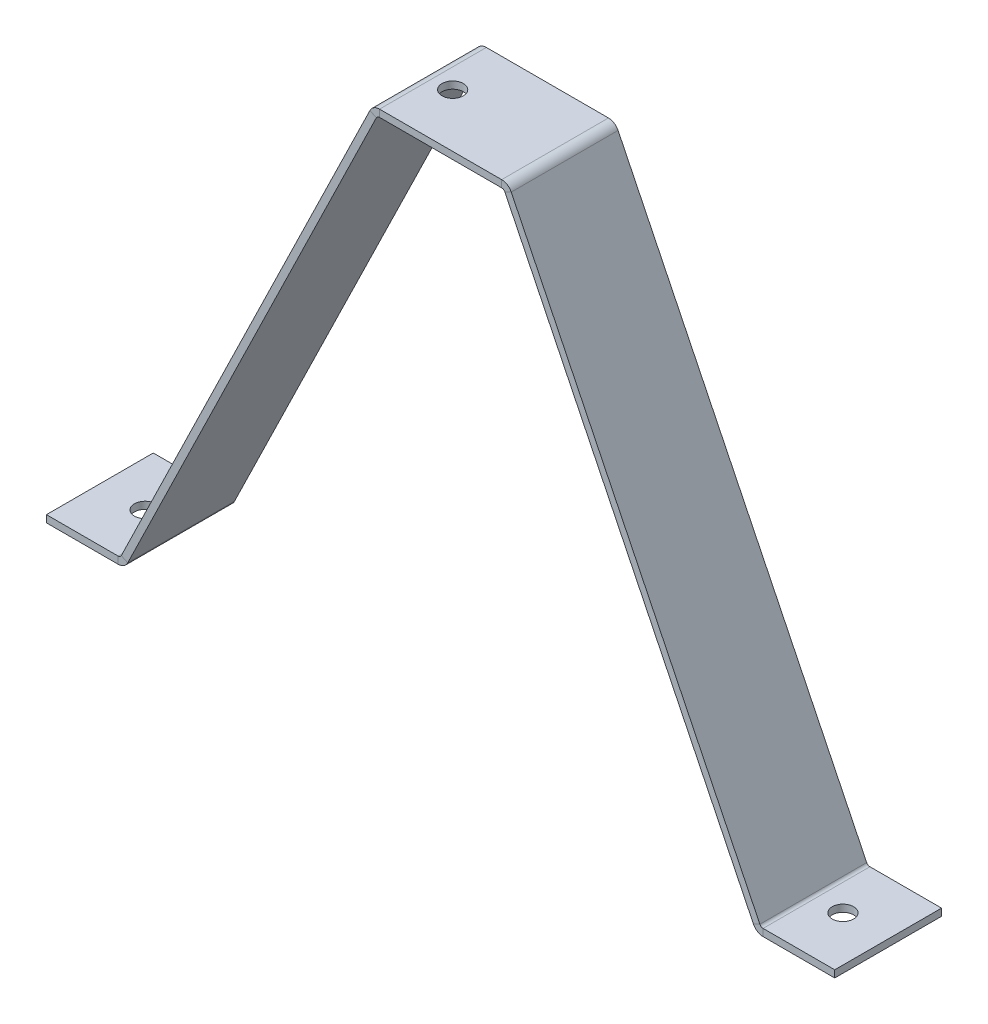
ISO-10303-21;
HEADER;
FILE_DESCRIPTION(('STEP AP214'),'2;1');
FILE_NAME('part.step','',(''),(''),'','','');
FILE_SCHEMA(('AUTOMOTIVE_DESIGN { 1 0 10303 214 1 1 1 1 }'));
ENDSEC;
DATA;
#1=APPLICATION_CONTEXT('core data for automotive mechanical design processes');
#2=APPLICATION_PROTOCOL_DEFINITION('international standard','automotive_design',2000,#1);
#3=PRODUCT_CONTEXT('',#1,'mechanical');
#4=PRODUCT('Part','Part','',(#3));
#5=PRODUCT_RELATED_PRODUCT_CATEGORY('part','',(#4));
#6=PRODUCT_DEFINITION_FORMATION('','',#4);
#7=PRODUCT_DEFINITION_CONTEXT('part definition',#1,'design');
#8=PRODUCT_DEFINITION('design','',#6,#7);
#9=PRODUCT_DEFINITION_SHAPE('','',#8);
#10=(LENGTH_UNIT() NAMED_UNIT(*) SI_UNIT(.MILLI.,.METRE.));
#11=(NAMED_UNIT(*) PLANE_ANGLE_UNIT() SI_UNIT($,.RADIAN.));
#12=(NAMED_UNIT(*) SI_UNIT($,.STERADIAN.) SOLID_ANGLE_UNIT());
#13=UNCERTAINTY_MEASURE_WITH_UNIT(LENGTH_MEASURE(1.E-05),#10,'distance_accuracy_value','');
#14=(GEOMETRIC_REPRESENTATION_CONTEXT(3) GLOBAL_UNCERTAINTY_ASSIGNED_CONTEXT((#13)) GLOBAL_UNIT_ASSIGNED_CONTEXT((#10,
#11,#12)) REPRESENTATION_CONTEXT('',''));
#15=CARTESIAN_POINT('',(0.,0.,0.));
#16=DIRECTION('',(0.,0.,1.));
#17=DIRECTION('',(1.,0.,0.));
#18=AXIS2_PLACEMENT_3D('',#15,#16,#17);
#19=CARTESIAN_POINT('',(9.78619210582397,0.438371146789082,-7.5));
#20=DIRECTION('',(0.,0.,-1.));
#21=DIRECTION('',(-1.,0.,0.));
#22=AXIS2_PLACEMENT_3D('',#19,#20,#21);
#23=PLANE('',#22);
#24=DIRECTION('',(-0.438371146789082,0.898794046299165,0.));
#25=VECTOR('',#24,1.);
#26=CARTESIAN_POINT('',(9.78619210582398,0.438371146789083,-7.5));
#27=LINE('',#26,#25);
#28=CARTESIAN_POINT('',(9.9231544530189,0.157556720183625,-7.5));
#29=VERTEX_POINT('',#28);
#30=CARTESIAN_POINT('',(44.8340065123781,-71.4202973699261,-7.50000000000001));
#31=VERTEX_POINT('',#30);
#32=EDGE_CURVE('E376',#29,#31,#27,.F.);
#33=ORIENTED_EDGE('',*,*,#32,.T.);
#34=DIRECTION('',(-0.898794046299163,-0.438371146789085,0.));
#35=VECTOR('',#34,1.);
#36=CARTESIAN_POINT('',(44.8340065123781,-71.4202973699261,-7.50000000000001));
#37=LINE('',#36,#35);
#38=CARTESIAN_POINT('',(43.9352124660789,-71.8586685167152,-7.50000000000001));
#39=VERTEX_POINT('',#38);
#40=EDGE_CURVE('E307',#31,#39,#37,.T.);
#41=ORIENTED_EDGE('',*,*,#40,.T.);
#42=DIRECTION('',(0.438371146789082,-0.898794046299165,0.));
#43=VECTOR('',#42,1.);
#44=CARTESIAN_POINT('',(6.96570543615307,3.94005376803364,-7.5));
#45=LINE('',#44,#43);
#46=CARTESIAN_POINT('',(9.02436040671973,-0.280814426605457,-7.5));
#47=VERTEX_POINT('',#46);
#48=EDGE_CURVE('E381',#47,#39,#45,.T.);
#49=ORIENTED_EDGE('',*,*,#48,.F.);
#50=DIRECTION('',(0.898794046299165,0.438371146789082,0.));
#51=VECTOR('',#50,1.);
#52=CARTESIAN_POINT('',(9.92315445301889,0.157556720183623,-7.5));
#53=LINE('',#52,#51);
#54=EDGE_CURVE('E371',#47,#29,#53,.T.);
#55=ORIENTED_EDGE('',*,*,#54,.T.);
#56=EDGE_LOOP('',(#33,#41,#49,#55));
#57=FACE_BOUND('',#56,.T.);
#58=ADVANCED_FACE('F119',(#57),#23,.T.);
#59=CARTESIAN_POINT('',(7.86449948245223,4.37842491482272,0.));
#60=DIRECTION('',(-0.898794046299165,-0.438371146789082,0.));
#61=DIRECTION('',(0.438371146789082,-0.898794046299165,0.));
#62=AXIS2_PLACEMENT_3D('',#59,#60,#61);
#63=PLANE('',#62);
#64=DIRECTION('',(0.,0.,-1.));
#65=VECTOR('',#64,1.);
#66=CARTESIAN_POINT('',(44.8340065123781,-71.4202973699261,-7.50000000000001));
#67=LINE('',#66,#65);
#68=CARTESIAN_POINT('',(44.8340065123781,-71.4202973699261,7.49999999999999));
#69=VERTEX_POINT('',#68);
#70=EDGE_CURVE('E313',#31,#69,#67,.F.);
#71=ORIENTED_EDGE('',*,*,#70,.F.);
#72=ORIENTED_EDGE('',*,*,#32,.F.);
#73=DIRECTION('',(0.,0.,1.));
#74=VECTOR('',#73,1.);
#75=CARTESIAN_POINT('',(9.9231544530189,0.157556720183625,-7.50000000000001));
#76=LINE('',#75,#74);
#77=CARTESIAN_POINT('',(9.9231544530189,0.157556720183617,7.5));
#78=VERTEX_POINT('',#77);
#79=EDGE_CURVE('E384',#78,#29,#76,.F.);
#80=ORIENTED_EDGE('',*,*,#79,.F.);
#81=DIRECTION('',(0.438371146789082,-0.898794046299165,0.));
#82=VECTOR('',#81,1.);
#83=CARTESIAN_POINT('',(45.4587014481388,-72.7011117965315,7.49999999999999));
#84=LINE('',#83,#82);
#85=EDGE_CURVE('E373',#69,#78,#84,.F.);
#86=ORIENTED_EDGE('',*,*,#85,.F.);
#87=EDGE_LOOP('',(#71,#72,#80,#86));
#88=FACE_BOUND('',#87,.T.);
#89=ADVANCED_FACE('F533',(#88),#63,.F.);
#90=CARTESIAN_POINT('',(6.96570543615307,3.94005376803364,0.));
#91=DIRECTION('',(-0.898794046299165,-0.438371146789082,0.));
#92=DIRECTION('',(0.438371146789082,-0.898794046299165,0.));
#93=AXIS2_PLACEMENT_3D('',#90,#91,#92);
#94=PLANE('',#93);
#95=ORIENTED_EDGE('',*,*,#48,.T.);
#96=DIRECTION('',(0.,0.,-1.));
#97=VECTOR('',#96,1.);
#98=CARTESIAN_POINT('',(43.9352124660789,-71.8586685167152,-7.50000000000001));
#99=LINE('',#98,#97);
#100=CARTESIAN_POINT('',(43.9352124660789,-71.8586685167152,7.49999999999999));
#101=VERTEX_POINT('',#100);
#102=EDGE_CURVE('E302',#39,#101,#99,.F.);
#103=ORIENTED_EDGE('',*,*,#102,.T.);
#104=DIRECTION('',(-0.438371146789082,0.898794046299165,0.));
#105=VECTOR('',#104,1.);
#106=CARTESIAN_POINT('',(6.96570543615307,3.94005376803364,7.5));
#107=LINE('',#106,#105);
#108=CARTESIAN_POINT('',(9.02436040671973,-0.280814426605465,7.5));
#109=VERTEX_POINT('',#108);
#110=EDGE_CURVE('E379',#101,#109,#107,.T.);
#111=ORIENTED_EDGE('',*,*,#110,.T.);
#112=DIRECTION('',(0.,0.,1.));
#113=VECTOR('',#112,1.);
#114=CARTESIAN_POINT('',(9.02436040671973,-0.280814426605456,-7.50000000000001));
#115=LINE('',#114,#113);
#116=EDGE_CURVE('E389',#47,#109,#115,.T.);
#117=ORIENTED_EDGE('',*,*,#116,.F.);
#118=EDGE_LOOP('',(#95,#103,#111,#117));
#119=FACE_BOUND('',#118,.T.);
#120=ADVANCED_FACE('F539',(#119),#94,.T.);
#121=CARTESIAN_POINT('',(-45.4587014481388,-72.7011117965315,7.5));
#122=DIRECTION('',(0.,0.,1.));
#123=DIRECTION('',(1.,0.,0.));
#124=AXIS2_PLACEMENT_3D('',#121,#122,#123);
#125=PLANE('',#124);
#126=DIRECTION('',(-0.438371146789081,-0.898794046299165,0.));
#127=VECTOR('',#126,1.);
#128=CARTESIAN_POINT('',(-45.4587014481388,-72.7011117965315,7.5));
#129=LINE('',#128,#127);
#130=CARTESIAN_POINT('',(-9.92315445301889,0.157556720183624,7.5));
#131=VERTEX_POINT('',#130);
#132=CARTESIAN_POINT('',(-44.834006512378,-71.4202973699261,7.5));
#133=VERTEX_POINT('',#132);
#134=EDGE_CURVE('E420',#131,#133,#129,.T.);
#135=ORIENTED_EDGE('',*,*,#134,.T.);
#136=DIRECTION('',(0.89879404629916,-0.438371146789091,0.));
#137=VECTOR('',#136,1.);
#138=CARTESIAN_POINT('',(-44.8340065123781,-71.4202973699261,7.50000000000001));
#139=LINE('',#138,#137);
#140=CARTESIAN_POINT('',(-43.9352124660789,-71.8586685167152,7.50000000000001));
#141=VERTEX_POINT('',#140);
#142=EDGE_CURVE('E359',#133,#141,#139,.T.);
#143=ORIENTED_EDGE('',*,*,#142,.T.);
#144=DIRECTION('',(0.438371146789081,0.898794046299165,0.));
#145=VECTOR('',#144,1.);
#146=CARTESIAN_POINT('',(-6.96570543615306,3.94005376803364,7.5));
#147=LINE('',#146,#145);
#148=CARTESIAN_POINT('',(-9.02436040671973,-0.280814426605458,7.5));
#149=VERTEX_POINT('',#148);
#150=EDGE_CURVE('E425',#149,#141,#147,.F.);
#151=ORIENTED_EDGE('',*,*,#150,.F.);
#152=DIRECTION('',(-0.898794046299165,0.438371146789081,0.));
#153=VECTOR('',#152,1.);
#154=CARTESIAN_POINT('',(-9.92315445301891,0.157556720183624,7.5));
#155=LINE('',#154,#153);
#156=EDGE_CURVE('E414',#149,#131,#155,.T.);
#157=ORIENTED_EDGE('',*,*,#156,.T.);
#158=EDGE_LOOP('',(#135,#143,#151,#157));
#159=FACE_BOUND('',#158,.T.);
#160=ADVANCED_FACE('F487',(#159),#125,.T.);
#161=CARTESIAN_POINT('',(-7.86449948245223,4.37842491482272,0.));
#162=DIRECTION('',(-0.898794046299165,0.438371146789081,0.));
#163=DIRECTION('',(-0.438371146789081,-0.898794046299165,0.));
#164=AXIS2_PLACEMENT_3D('',#161,#162,#163);
#165=PLANE('',#164);
#166=DIRECTION('',(0.438371146789081,0.898794046299165,0.));
#167=VECTOR('',#166,1.);
#168=CARTESIAN_POINT('',(-9.78619210582397,0.438371146789081,-7.5));
#169=LINE('',#168,#167);
#170=CARTESIAN_POINT('',(-44.834006512378,-71.4202973699261,-7.5));
#171=VERTEX_POINT('',#170);
#172=CARTESIAN_POINT('',(-9.92315445301889,0.157556720183624,-7.5));
#173=VERTEX_POINT('',#172);
#174=EDGE_CURVE('E417',#171,#173,#169,.T.);
#175=ORIENTED_EDGE('',*,*,#174,.F.);
#176=DIRECTION('',(0.,0.,1.));
#177=VECTOR('',#176,1.);
#178=CARTESIAN_POINT('',(-44.8340065123781,-71.4202973699261,7.50000000000001));
#179=LINE('',#178,#177);
#180=EDGE_CURVE('E365',#133,#171,#179,.F.);
#181=ORIENTED_EDGE('',*,*,#180,.F.);
#182=ORIENTED_EDGE('',*,*,#134,.F.);
#183=DIRECTION('',(0.,0.,-1.));
#184=VECTOR('',#183,1.);
#185=CARTESIAN_POINT('',(-9.92315445301889,0.157556720183624,0.));
#186=LINE('',#185,#184);
#187=EDGE_CURVE('E428',#131,#173,#186,.T.);
#188=ORIENTED_EDGE('',*,*,#187,.T.);
#189=EDGE_LOOP('',(#175,#181,#182,#188));
#190=FACE_BOUND('',#189,.T.);
#191=ADVANCED_FACE('F490',(#190),#165,.T.);
#192=CARTESIAN_POINT('',(-6.96570543615307,3.94005376803364,0.));
#193=DIRECTION('',(-0.898794046299165,0.438371146789081,0.));
#194=DIRECTION('',(-0.438371146789081,-0.898794046299165,0.));
#195=AXIS2_PLACEMENT_3D('',#192,#193,#194);
#196=PLANE('',#195);
#197=DIRECTION('',(0.,0.,1.));
#198=VECTOR('',#197,1.);
#199=CARTESIAN_POINT('',(-43.9352124660789,-71.8586685167152,7.50000000000001));
#200=LINE('',#199,#198);
#201=CARTESIAN_POINT('',(-43.9352124660789,-71.8586685167152,-7.5));
#202=VERTEX_POINT('',#201);
#203=EDGE_CURVE('E353',#141,#202,#200,.F.);
#204=ORIENTED_EDGE('',*,*,#203,.T.);
#205=DIRECTION('',(-0.438371146789081,-0.898794046299165,0.));
#206=VECTOR('',#205,1.);
#207=CARTESIAN_POINT('',(-6.96570543615307,3.94005376803364,-7.5));
#208=LINE('',#207,#206);
#209=CARTESIAN_POINT('',(-9.02436040671973,-0.280814426605458,-7.5));
#210=VERTEX_POINT('',#209);
#211=EDGE_CURVE('E423',#202,#210,#208,.F.);
#212=ORIENTED_EDGE('',*,*,#211,.T.);
#213=DIRECTION('',(0.,0.,1.));
#214=VECTOR('',#213,1.);
#215=CARTESIAN_POINT('',(-9.02436040671973,-0.280814426605458,7.5));
#216=LINE('',#215,#214);
#217=EDGE_CURVE('E434',#149,#210,#216,.F.);
#218=ORIENTED_EDGE('',*,*,#217,.F.);
#219=ORIENTED_EDGE('',*,*,#150,.T.);
#220=EDGE_LOOP('',(#204,#212,#218,#219));
#221=FACE_BOUND('',#220,.T.);
#222=ADVANCED_FACE('F565',(#221),#196,.F.);
#223=CARTESIAN_POINT('',(0.,1.,0.));
#224=DIRECTION('',(0.,1.,0.));
#225=DIRECTION('',(0.,0.,1.));
#226=AXIS2_PLACEMENT_3D('',#223,#224,#225);
#227=PLANE('',#226);
#228=CARTESIAN_POINT('',(-5.80496338357015,1.,0.));
#229=DIRECTION('',(0.,1.,0.));
#230=DIRECTION('',(0.,0.,1.));
#231=AXIS2_PLACEMENT_3D('',#228,#229,#230);
#232=CIRCLE('',#231,1.5);
#233=CARTESIAN_POINT('',(-5.80496338357015,1.,1.5));
#234=VERTEX_POINT('',#233);
#235=EDGE_CURVE('E655',#234,#234,#232,.T.);
#236=ORIENTED_EDGE('',*,*,#235,.F.);
#237=EDGE_LOOP('',(#236));
#238=FACE_BOUND('',#237,.T.);
#239=DIRECTION('',(1.,0.,0.));
#240=VECTOR('',#239,1.);
#241=CARTESIAN_POINT('',(-10.,1.,7.5));
#242=LINE('',#241,#240);
#243=CARTESIAN_POINT('',(-8.57496338357015,1.,7.5));
#244=VERTEX_POINT('',#243);
#245=CARTESIAN_POINT('',(8.57496338357016,0.999999999999993,7.5));
#246=VERTEX_POINT('',#245);
#247=EDGE_CURVE('E13',#244,#246,#242,.T.);
#248=ORIENTED_EDGE('',*,*,#247,.T.);
#249=DIRECTION('',(0.,0.,1.));
#250=VECTOR('',#249,1.);
#251=CARTESIAN_POINT('',(8.57496338357016,0.999999999999993,7.5));
#252=LINE('',#251,#250);
#253=CARTESIAN_POINT('',(8.57496338357015,1.,-7.5));
#254=VERTEX_POINT('',#253);
#255=EDGE_CURVE('E394',#246,#254,#252,.F.);
#256=ORIENTED_EDGE('',*,*,#255,.T.);
#257=DIRECTION('',(-1.,0.,0.));
#258=VECTOR('',#257,1.);
#259=CARTESIAN_POINT('',(-10.,1.,-7.5));
#260=LINE('',#259,#258);
#261=CARTESIAN_POINT('',(-8.57496338357015,1.,-7.5));
#262=VERTEX_POINT('',#261);
#263=EDGE_CURVE('E128',#254,#262,#260,.T.);
#264=ORIENTED_EDGE('',*,*,#263,.T.);
#265=DIRECTION('',(0.,0.,-1.));
#266=VECTOR('',#265,1.);
#267=CARTESIAN_POINT('',(-8.57496338357015,1.,-7.5));
#268=LINE('',#267,#266);
#269=EDGE_CURVE('E439',#262,#244,#268,.F.);
#270=ORIENTED_EDGE('',*,*,#269,.T.);
#271=EDGE_LOOP('',(#248,#256,#264,#270));
#272=FACE_BOUND('',#271,.T.);
#273=ADVANCED_FACE('F568',(#238,#272),#227,.T.);
#274=CARTESIAN_POINT('',(0.,0.,0.));
#275=DIRECTION('',(0.,1.,0.));
#276=DIRECTION('',(0.,0.,1.));
#277=AXIS2_PLACEMENT_3D('',#274,#275,#276);
#278=PLANE('',#277);
#279=CARTESIAN_POINT('',(-5.80496338357015,0.,0.));
#280=DIRECTION('',(0.,1.,0.));
#281=DIRECTION('',(0.,0.,1.));
#282=AXIS2_PLACEMENT_3D('',#279,#280,#281);
#283=CIRCLE('',#282,1.5);
#284=CARTESIAN_POINT('',(-5.80496338357015,0.,1.5));
#285=VERTEX_POINT('',#284);
#286=EDGE_CURVE('E123',#285,#285,#283,.T.);
#287=ORIENTED_EDGE('',*,*,#286,.T.);
#288=EDGE_LOOP('',(#287));
#289=FACE_BOUND('',#288,.T.);
#290=DIRECTION('',(0.,0.,1.));
#291=VECTOR('',#290,1.);
#292=CARTESIAN_POINT('',(8.57496338357015,0.,7.5));
#293=LINE('',#292,#291);
#294=CARTESIAN_POINT('',(8.57496338357015,0.,7.5));
#295=VERTEX_POINT('',#294);
#296=CARTESIAN_POINT('',(8.57496338357015,0.,-7.5));
#297=VERTEX_POINT('',#296);
#298=EDGE_CURVE('E407',#295,#297,#293,.F.);
#299=ORIENTED_EDGE('',*,*,#298,.F.);
#300=DIRECTION('',(1.,0.,0.));
#301=VECTOR('',#300,1.);
#302=CARTESIAN_POINT('',(0.,0.,7.5));
#303=LINE('',#302,#301);
#304=CARTESIAN_POINT('',(-8.57496338357015,0.,7.5));
#305=VERTEX_POINT('',#304);
#306=EDGE_CURVE('E463',#305,#295,#303,.T.);
#307=ORIENTED_EDGE('',*,*,#306,.F.);
#308=DIRECTION('',(0.,0.,-1.));
#309=VECTOR('',#308,1.);
#310=CARTESIAN_POINT('',(-8.57496338357015,0.,-7.5));
#311=LINE('',#310,#309);
#312=CARTESIAN_POINT('',(-8.57496338357015,0.,-7.5));
#313=VERTEX_POINT('',#312);
#314=EDGE_CURVE('E452',#313,#305,#311,.F.);
#315=ORIENTED_EDGE('',*,*,#314,.F.);
#316=DIRECTION('',(1.,0.,0.));
#317=VECTOR('',#316,1.);
#318=CARTESIAN_POINT('',(0.,0.,-7.5));
#319=LINE('',#318,#317);
#320=EDGE_CURVE('E459',#297,#313,#319,.F.);
#321=ORIENTED_EDGE('',*,*,#320,.F.);
#322=EDGE_LOOP('',(#299,#307,#315,#321));
#323=FACE_BOUND('',#322,.T.);
#324=ADVANCED_FACE('F475',(#289,#323),#278,.F.);
#325=CARTESIAN_POINT('',(-10.,1.,7.5));
#326=DIRECTION('',(0.,0.,1.));
#327=DIRECTION('',(1.,0.,0.));
#328=AXIS2_PLACEMENT_3D('',#325,#326,#327);
#329=PLANE('',#328);
#330=ORIENTED_EDGE('',*,*,#306,.T.);
#331=DIRECTION('',(0.,1.,0.));
#332=VECTOR('',#331,1.);
#333=CARTESIAN_POINT('',(8.57496338357015,0.,7.5));
#334=LINE('',#333,#332);
#335=EDGE_CURVE('E401',#295,#246,#334,.T.);
#336=ORIENTED_EDGE('',*,*,#335,.T.);
#337=ORIENTED_EDGE('',*,*,#247,.F.);
#338=DIRECTION('',(0.,1.,0.));
#339=VECTOR('',#338,1.);
#340=CARTESIAN_POINT('',(-8.57496338357015,0.,7.5));
#341=LINE('',#340,#339);
#342=EDGE_CURVE('E456',#305,#244,#341,.T.);
#343=ORIENTED_EDGE('',*,*,#342,.F.);
#344=EDGE_LOOP('',(#330,#336,#337,#343));
#345=FACE_BOUND('',#344,.T.);
#346=ADVANCED_FACE('F590',(#345),#329,.T.);
#347=CARTESIAN_POINT('',(-10.,1.,-7.5));
#348=DIRECTION('',(0.,0.,-1.));
#349=DIRECTION('',(-1.,0.,0.));
#350=AXIS2_PLACEMENT_3D('',#347,#348,#349);
#351=PLANE('',#350);
#352=DIRECTION('',(0.,1.,0.));
#353=VECTOR('',#352,1.);
#354=CARTESIAN_POINT('',(8.57496338357015,0.,-7.5));
#355=LINE('',#354,#353);
#356=EDGE_CURVE('E411',#297,#254,#355,.T.);
#357=ORIENTED_EDGE('',*,*,#356,.F.);
#358=ORIENTED_EDGE('',*,*,#320,.T.);
#359=DIRECTION('',(0.,1.,0.));
#360=VECTOR('',#359,1.);
#361=CARTESIAN_POINT('',(-8.57496338357015,0.,-7.5));
#362=LINE('',#361,#360);
#363=EDGE_CURVE('E446',#313,#262,#362,.T.);
#364=ORIENTED_EDGE('',*,*,#363,.T.);
#365=ORIENTED_EDGE('',*,*,#263,.F.);
#366=EDGE_LOOP('',(#357,#358,#364,#365));
#367=FACE_BOUND('',#366,.T.);
#368=ADVANCED_FACE('F121',(#367),#351,.T.);
#369=CARTESIAN_POINT('',(-8.57496338357015,-0.499999999999998,7.5));
#370=DIRECTION('',(0.,0.,1.));
#371=DIRECTION('',(1.,0.,0.));
#372=AXIS2_PLACEMENT_3D('',#369,#370,#371);
#373=PLANE('',#372);
#374=ORIENTED_EDGE('',*,*,#156,.F.);
#375=CARTESIAN_POINT('',(-8.57496338357015,-0.499999999999998,7.5));
#376=DIRECTION('',(0.,0.,-1.));
#377=DIRECTION('',(-1.,0.,0.));
#378=AXIS2_PLACEMENT_3D('',#375,#376,#377);
#379=CIRCLE('',#378,0.499999999999998);
#380=EDGE_CURVE('E449',#305,#149,#379,.F.);
#381=ORIENTED_EDGE('',*,*,#380,.F.);
#382=ORIENTED_EDGE('',*,*,#342,.T.);
#383=CARTESIAN_POINT('',(-8.57496338357015,-0.499999999999998,7.5));
#384=DIRECTION('',(0.,0.,-1.));
#385=DIRECTION('',(-1.,0.,0.));
#386=AXIS2_PLACEMENT_3D('',#383,#384,#385);
#387=CIRCLE('',#386,1.5);
#388=EDGE_CURVE('E442',#244,#131,#387,.F.);
#389=ORIENTED_EDGE('',*,*,#388,.T.);
#390=EDGE_LOOP('',(#374,#381,#382,#389));
#391=FACE_BOUND('',#390,.T.);
#392=ADVANCED_FACE('F483',(#391),#373,.T.);
#393=CARTESIAN_POINT('',(-8.57496338357015,-0.499999999999998,-7.5));
#394=DIRECTION('',(0.,0.,1.));
#395=DIRECTION('',(1.,0.,0.));
#396=AXIS2_PLACEMENT_3D('',#393,#394,#395);
#397=PLANE('',#396);
#398=CARTESIAN_POINT('',(-8.57496338357015,-0.499999999999998,-7.5));
#399=DIRECTION('',(0.,0.,-1.));
#400=DIRECTION('',(-1.,0.,0.));
#401=AXIS2_PLACEMENT_3D('',#398,#399,#400);
#402=CIRCLE('',#401,0.499999999999998);
#403=EDGE_CURVE('E419',#210,#313,#402,.T.);
#404=ORIENTED_EDGE('',*,*,#403,.F.);
#405=DIRECTION('',(-0.898794046299165,0.438371146789081,0.));
#406=VECTOR('',#405,1.);
#407=CARTESIAN_POINT('',(-9.02436040671973,-0.280814426605458,-7.5));
#408=LINE('',#407,#406);
#409=EDGE_CURVE('E431',#210,#173,#408,.T.);
#410=ORIENTED_EDGE('',*,*,#409,.T.);
#411=CARTESIAN_POINT('',(-8.57496338357015,-0.499999999999998,-7.5));
#412=DIRECTION('',(0.,0.,-1.));
#413=DIRECTION('',(-1.,0.,0.));
#414=AXIS2_PLACEMENT_3D('',#411,#412,#413);
#415=CIRCLE('',#414,1.5);
#416=EDGE_CURVE('E443',#173,#262,#415,.T.);
#417=ORIENTED_EDGE('',*,*,#416,.T.);
#418=ORIENTED_EDGE('',*,*,#363,.F.);
#419=EDGE_LOOP('',(#404,#410,#417,#418));
#420=FACE_BOUND('',#419,.T.);
#421=ADVANCED_FACE('F577',(#420),#397,.F.);
#422=CARTESIAN_POINT('',(-8.57496338357015,-0.499999999999998,-7.5));
#423=DIRECTION('',(0.,0.,-1.));
#424=DIRECTION('',(-0.898794046299165,0.438371146789081,0.));
#425=AXIS2_PLACEMENT_3D('',#422,#423,#424);
#426=CYLINDRICAL_SURFACE('',#425,1.5);
#427=ORIENTED_EDGE('',*,*,#269,.F.);
#428=ORIENTED_EDGE('',*,*,#416,.F.);
#429=ORIENTED_EDGE('',*,*,#187,.F.);
#430=ORIENTED_EDGE('',*,*,#388,.F.);
#431=EDGE_LOOP('',(#427,#428,#429,#430));
#432=FACE_BOUND('',#431,.T.);
#433=ADVANCED_FACE('F574',(#432),#426,.T.);
#434=CARTESIAN_POINT('',(-8.57496338357015,-0.499999999999998,-7.5));
#435=DIRECTION('',(0.,0.,-1.));
#436=DIRECTION('',(-0.898794046299165,0.438371146789081,0.));
#437=AXIS2_PLACEMENT_3D('',#434,#435,#436);
#438=CYLINDRICAL_SURFACE('',#437,0.499999999999998);
#439=ORIENTED_EDGE('',*,*,#314,.T.);
#440=ORIENTED_EDGE('',*,*,#380,.T.);
#441=ORIENTED_EDGE('',*,*,#217,.T.);
#442=ORIENTED_EDGE('',*,*,#403,.T.);
#443=EDGE_LOOP('',(#439,#440,#441,#442));
#444=FACE_BOUND('',#443,.T.);
#445=ADVANCED_FACE('F479',(#444),#438,.F.);
#446=CARTESIAN_POINT('',(-9.78619210582397,0.438371146789081,-7.5));
#447=DIRECTION('',(0.,0.,-1.));
#448=DIRECTION('',(-1.,0.,0.));
#449=AXIS2_PLACEMENT_3D('',#446,#447,#448);
#450=PLANE('',#449);
#451=DIRECTION('',(0.89879404629916,-0.438371146789091,0.));
#452=VECTOR('',#451,1.);
#453=CARTESIAN_POINT('',(-44.8340065123781,-71.4202973699261,-7.5));
#454=LINE('',#453,#452);
#455=EDGE_CURVE('E144',#171,#202,#454,.T.);
#456=ORIENTED_EDGE('',*,*,#455,.F.);
#457=ORIENTED_EDGE('',*,*,#174,.T.);
#458=ORIENTED_EDGE('',*,*,#409,.F.);
#459=ORIENTED_EDGE('',*,*,#211,.F.);
#460=EDGE_LOOP('',(#456,#457,#458,#459));
#461=FACE_BOUND('',#460,.T.);
#462=ADVANCED_FACE('F558',(#461),#450,.T.);
#463=CARTESIAN_POINT('',(8.57496338357015,-0.499999999999996,-7.5));
#464=DIRECTION('',(0.,0.,-1.));
#465=DIRECTION('',(0.,1.,0.));
#466=AXIS2_PLACEMENT_3D('',#463,#464,#465);
#467=PLANE('',#466);
#468=ORIENTED_EDGE('',*,*,#54,.F.);
#469=CARTESIAN_POINT('',(8.57496338357015,-0.499999999999996,-7.5));
#470=DIRECTION('',(0.,0.,1.));
#471=DIRECTION('',(0.,-1.,0.));
#472=AXIS2_PLACEMENT_3D('',#469,#470,#471);
#473=CIRCLE('',#472,0.499999999999998);
#474=EDGE_CURVE('E404',#297,#47,#473,.F.);
#475=ORIENTED_EDGE('',*,*,#474,.F.);
#476=ORIENTED_EDGE('',*,*,#356,.T.);
#477=CARTESIAN_POINT('',(8.57496338357015,-0.499999999999996,-7.5));
#478=DIRECTION('',(0.,0.,1.));
#479=DIRECTION('',(0.,-1.,0.));
#480=AXIS2_PLACEMENT_3D('',#477,#478,#479);
#481=CIRCLE('',#480,1.5);
#482=EDGE_CURVE('E397',#254,#29,#481,.F.);
#483=ORIENTED_EDGE('',*,*,#482,.T.);
#484=EDGE_LOOP('',(#468,#475,#476,#483));
#485=FACE_BOUND('',#484,.T.);
#486=ADVANCED_FACE('F555',(#485),#467,.T.);
#487=CARTESIAN_POINT('',(8.57496338357015,-0.500000000000005,7.5));
#488=DIRECTION('',(0.,0.,-1.));
#489=DIRECTION('',(0.,1.,0.));
#490=AXIS2_PLACEMENT_3D('',#487,#488,#489);
#491=PLANE('',#490);
#492=CARTESIAN_POINT('',(8.57496338357015,-0.500000000000005,7.5));
#493=DIRECTION('',(0.,0.,1.));
#494=DIRECTION('',(0.,-1.,0.));
#495=AXIS2_PLACEMENT_3D('',#492,#493,#494);
#496=CIRCLE('',#495,0.499999999999998);
#497=EDGE_CURVE('E375',#109,#295,#496,.T.);
#498=ORIENTED_EDGE('',*,*,#497,.F.);
#499=DIRECTION('',(0.898794046299165,0.438371146789082,0.));
#500=VECTOR('',#499,1.);
#501=CARTESIAN_POINT('',(9.02436040671973,-0.280814426605464,7.5));
#502=LINE('',#501,#500);
#503=EDGE_CURVE('E386',#109,#78,#502,.T.);
#504=ORIENTED_EDGE('',*,*,#503,.T.);
#505=CARTESIAN_POINT('',(8.57496338357015,-0.500000000000005,7.5));
#506=DIRECTION('',(0.,0.,1.));
#507=DIRECTION('',(0.,-1.,0.));
#508=AXIS2_PLACEMENT_3D('',#505,#506,#507);
#509=CIRCLE('',#508,1.5);
#510=EDGE_CURVE('E398',#78,#246,#509,.T.);
#511=ORIENTED_EDGE('',*,*,#510,.T.);
#512=ORIENTED_EDGE('',*,*,#335,.F.);
#513=EDGE_LOOP('',(#498,#504,#511,#512));
#514=FACE_BOUND('',#513,.T.);
#515=ADVANCED_FACE('F550',(#514),#491,.F.);
#516=CARTESIAN_POINT('',(8.57496338357015,-0.500000000000005,7.5));
#517=DIRECTION('',(0.,0.,1.));
#518=DIRECTION('',(0.898794046299165,0.438371146789082,0.));
#519=AXIS2_PLACEMENT_3D('',#516,#517,#518);
#520=CYLINDRICAL_SURFACE('',#519,1.5);
#521=ORIENTED_EDGE('',*,*,#255,.F.);
#522=ORIENTED_EDGE('',*,*,#510,.F.);
#523=ORIENTED_EDGE('',*,*,#79,.T.);
#524=ORIENTED_EDGE('',*,*,#482,.F.);
#525=EDGE_LOOP('',(#521,#522,#523,#524));
#526=FACE_BOUND('',#525,.T.);
#527=ADVANCED_FACE('F546',(#526),#520,.T.);
#528=CARTESIAN_POINT('',(8.57496338357015,-0.500000000000005,7.5));
#529=DIRECTION('',(0.,0.,1.));
#530=DIRECTION('',(0.898794046299165,0.438371146789082,0.));
#531=AXIS2_PLACEMENT_3D('',#528,#529,#530);
#532=CYLINDRICAL_SURFACE('',#531,0.499999999999998);
#533=ORIENTED_EDGE('',*,*,#298,.T.);
#534=ORIENTED_EDGE('',*,*,#474,.T.);
#535=ORIENTED_EDGE('',*,*,#116,.T.);
#536=ORIENTED_EDGE('',*,*,#497,.T.);
#537=EDGE_LOOP('',(#533,#534,#535,#536));
#538=FACE_BOUND('',#537,.T.);
#539=ADVANCED_FACE('F549',(#538),#532,.F.);
#540=CARTESIAN_POINT('',(45.4587014481388,-72.7011117965315,7.49999999999999));
#541=DIRECTION('',(0.,0.,1.));
#542=DIRECTION('',(1.,0.,0.));
#543=AXIS2_PLACEMENT_3D('',#540,#541,#542);
#544=PLANE('',#543);
#545=DIRECTION('',(-0.898794046299163,-0.438371146789085,0.));
#546=VECTOR('',#545,1.);
#547=CARTESIAN_POINT('',(44.8340065123781,-71.4202973699261,7.49999999999999));
#548=LINE('',#547,#546);
#549=EDGE_CURVE('E318',#69,#101,#548,.T.);
#550=ORIENTED_EDGE('',*,*,#549,.F.);
#551=ORIENTED_EDGE('',*,*,#85,.T.);
#552=ORIENTED_EDGE('',*,*,#503,.F.);
#553=ORIENTED_EDGE('',*,*,#110,.F.);
#554=EDGE_LOOP('',(#550,#551,#552,#553));
#555=FACE_BOUND('',#554,.T.);
#556=ADVANCED_FACE('F544',(#555),#544,.T.);
#557=CARTESIAN_POINT('',(-45.2834035355276,-71.2011117965315,-7.5));
#558=DIRECTION('',(0.,0.,-1.));
#559=DIRECTION('',(-1.,0.,0.));
#560=AXIS2_PLACEMENT_3D('',#557,#558,#559);
#561=PLANE('',#560);
#562=DIRECTION('',(0.,1.,0.));
#563=VECTOR('',#562,1.);
#564=CARTESIAN_POINT('',(-45.2834035355276,-72.7011117965315,-7.49999999999999));
#565=LINE('',#564,#563);
#566=CARTESIAN_POINT('',(-45.2834035355276,-71.7011117965315,-7.5));
#567=VERTEX_POINT('',#566);
#568=CARTESIAN_POINT('',(-45.2834035355276,-72.7011117965315,-7.5));
#569=VERTEX_POINT('',#568);
#570=EDGE_CURVE('E320',#567,#569,#565,.F.);
#571=ORIENTED_EDGE('',*,*,#570,.F.);
#572=CARTESIAN_POINT('',(-45.2834035355276,-71.2011117965315,-7.5));
#573=DIRECTION('',(0.,0.,1.));
#574=DIRECTION('',(1.,0.,0.));
#575=AXIS2_PLACEMENT_3D('',#572,#573,#574);
#576=CIRCLE('',#575,0.500000000000014);
#577=EDGE_CURVE('E362',#171,#567,#576,.F.);
#578=ORIENTED_EDGE('',*,*,#577,.F.);
#579=ORIENTED_EDGE('',*,*,#455,.T.);
#580=CARTESIAN_POINT('',(-45.2834035355276,-71.2011117965315,-7.5));
#581=DIRECTION('',(0.,0.,1.));
#582=DIRECTION('',(1.,0.,0.));
#583=AXIS2_PLACEMENT_3D('',#580,#581,#582);
#584=CIRCLE('',#583,1.50000000000001);
#585=EDGE_CURVE('E355',#202,#569,#584,.F.);
#586=ORIENTED_EDGE('',*,*,#585,.T.);
#587=EDGE_LOOP('',(#571,#578,#579,#586));
#588=FACE_BOUND('',#587,.T.);
#589=ADVANCED_FACE('F497',(#588),#561,.T.);
#590=CARTESIAN_POINT('',(-45.2834035355276,-71.2011117965315,7.50000000000001));
#591=DIRECTION('',(0.,0.,-1.));
#592=DIRECTION('',(-1.,0.,0.));
#593=AXIS2_PLACEMENT_3D('',#590,#591,#592);
#594=PLANE('',#593);
#595=CARTESIAN_POINT('',(-45.2834035355276,-71.2011117965315,7.50000000000001));
#596=DIRECTION('',(0.,0.,1.));
#597=DIRECTION('',(1.,0.,0.));
#598=AXIS2_PLACEMENT_3D('',#595,#596,#597);
#599=CIRCLE('',#598,0.500000000000014);
#600=CARTESIAN_POINT('',(-45.2834035355276,-71.7011117965315,7.50000000000001));
#601=VERTEX_POINT('',#600);
#602=EDGE_CURVE('E326',#601,#133,#599,.T.);
#603=ORIENTED_EDGE('',*,*,#602,.F.);
#604=DIRECTION('',(0.,1.,0.));
#605=VECTOR('',#604,1.);
#606=CARTESIAN_POINT('',(-45.2834035355276,-71.7011117965315,7.50000000000001));
#607=LINE('',#606,#605);
#608=CARTESIAN_POINT('',(-45.2834035355276,-72.7011117965315,7.50000000000001));
#609=VERTEX_POINT('',#608);
#610=EDGE_CURVE('E346',#601,#609,#607,.F.);
#611=ORIENTED_EDGE('',*,*,#610,.T.);
#612=CARTESIAN_POINT('',(-45.2834035355276,-71.2011117965315,7.50000000000001));
#613=DIRECTION('',(0.,0.,1.));
#614=DIRECTION('',(1.,0.,0.));
#615=AXIS2_PLACEMENT_3D('',#612,#613,#614);
#616=CIRCLE('',#615,1.50000000000001);
#617=EDGE_CURVE('E356',#609,#141,#616,.T.);
#618=ORIENTED_EDGE('',*,*,#617,.T.);
#619=ORIENTED_EDGE('',*,*,#142,.F.);
#620=EDGE_LOOP('',(#603,#611,#618,#619));
#621=FACE_BOUND('',#620,.T.);
#622=ADVANCED_FACE('F518',(#621),#594,.F.);
#623=CARTESIAN_POINT('',(-45.2834035355276,-71.2011117965315,7.50000000000001));
#624=DIRECTION('',(0.,0.,1.));
#625=DIRECTION('',(0.,-1.,0.));
#626=AXIS2_PLACEMENT_3D('',#623,#624,#625);
#627=CYLINDRICAL_SURFACE('',#626,1.50000000000001);
#628=ORIENTED_EDGE('',*,*,#203,.F.);
#629=ORIENTED_EDGE('',*,*,#617,.F.);
#630=DIRECTION('',(0.,0.,1.));
#631=VECTOR('',#630,1.);
#632=CARTESIAN_POINT('',(-45.2834035355276,-72.7011117965315,-7.49999999999996));
#633=LINE('',#632,#631);
#634=EDGE_CURVE('E344',#609,#569,#633,.F.);
#635=ORIENTED_EDGE('',*,*,#634,.T.);
#636=ORIENTED_EDGE('',*,*,#585,.F.);
#637=EDGE_LOOP('',(#628,#629,#635,#636));
#638=FACE_BOUND('',#637,.T.);
#639=ADVANCED_FACE('F528',(#638),#627,.T.);
#640=CARTESIAN_POINT('',(-45.2834035355276,-71.2011117965315,7.50000000000001));
#641=DIRECTION('',(0.,0.,1.));
#642=DIRECTION('',(0.,-1.,0.));
#643=AXIS2_PLACEMENT_3D('',#640,#641,#642);
#644=CYLINDRICAL_SURFACE('',#643,0.500000000000014);
#645=ORIENTED_EDGE('',*,*,#180,.T.);
#646=ORIENTED_EDGE('',*,*,#577,.T.);
#647=DIRECTION('',(0.,0.,1.));
#648=VECTOR('',#647,1.);
#649=CARTESIAN_POINT('',(-45.2834035355276,-71.7011117965316,-7.49999999999996));
#650=LINE('',#649,#648);
#651=EDGE_CURVE('E349',#567,#601,#650,.T.);
#652=ORIENTED_EDGE('',*,*,#651,.T.);
#653=ORIENTED_EDGE('',*,*,#602,.T.);
#654=EDGE_LOOP('',(#645,#646,#652,#653));
#655=FACE_BOUND('',#654,.T.);
#656=ADVANCED_FACE('F493',(#655),#644,.F.);
#657=CARTESIAN_POINT('',(-55.3460995076636,-72.7011117965315,7.50000000000007));
#658=DIRECTION('',(0.,0.,-1.));
#659=DIRECTION('',(-1.,0.,0.));
#660=AXIS2_PLACEMENT_3D('',#657,#658,#659);
#661=PLANE('',#660);
#662=ORIENTED_EDGE('',*,*,#610,.F.);
#663=DIRECTION('',(1.,0.,0.));
#664=VECTOR('',#663,1.);
#665=CARTESIAN_POINT('',(-55.3460995076636,-71.7011117965315,7.50000000000007));
#666=LINE('',#665,#664);
#667=CARTESIAN_POINT('',(-55.3460995076636,-71.7011117965315,7.50000000000007));
#668=VERTEX_POINT('',#667);
#669=EDGE_CURVE('E342',#601,#668,#666,.F.);
#670=ORIENTED_EDGE('',*,*,#669,.T.);
#671=DIRECTION('',(0.,1.,0.));
#672=VECTOR('',#671,1.);
#673=CARTESIAN_POINT('',(-55.3460995076636,-72.7011117965315,7.50000000000007));
#674=LINE('',#673,#672);
#675=CARTESIAN_POINT('',(-55.3460995076636,-72.7011117965315,7.50000000000007));
#676=VERTEX_POINT('',#675);
#677=EDGE_CURVE('E323',#676,#668,#674,.T.);
#678=ORIENTED_EDGE('',*,*,#677,.F.);
#679=DIRECTION('',(-1.,0.,0.));
#680=VECTOR('',#679,1.);
#681=CARTESIAN_POINT('',(0.487732588565916,-72.7011117965315,7.49999999999971));
#682=LINE('',#681,#680);
#683=EDGE_CURVE('E335',#609,#676,#682,.T.);
#684=ORIENTED_EDGE('',*,*,#683,.F.);
#685=EDGE_LOOP('',(#662,#670,#678,#684));
#686=FACE_BOUND('',#685,.T.);
#687=ADVANCED_FACE('F520',(#686),#661,.F.);
#688=CARTESIAN_POINT('',(-44.9709688595729,-72.7011117965315,-7.5));
#689=DIRECTION('',(0.,0.,1.));
#690=DIRECTION('',(1.,0.,0.));
#691=AXIS2_PLACEMENT_3D('',#688,#689,#690);
#692=PLANE('',#691);
#693=ORIENTED_EDGE('',*,*,#570,.T.);
#694=DIRECTION('',(1.,0.,0.));
#695=VECTOR('',#694,1.);
#696=CARTESIAN_POINT('',(0.487732588565818,-72.7011117965316,-7.50000000000029));
#697=LINE('',#696,#695);
#698=CARTESIAN_POINT('',(-55.3460995076636,-72.7011117965315,-7.49999999999993));
#699=VERTEX_POINT('',#698);
#700=EDGE_CURVE('E330',#699,#569,#697,.T.);
#701=ORIENTED_EDGE('',*,*,#700,.F.);
#702=DIRECTION('',(0.,1.,0.));
#703=VECTOR('',#702,1.);
#704=CARTESIAN_POINT('',(-55.3460995076636,-72.7011117965315,-7.49999999999993));
#705=LINE('',#704,#703);
#706=CARTESIAN_POINT('',(-55.3460995076636,-71.7011117965315,-7.49999999999993));
#707=VERTEX_POINT('',#706);
#708=EDGE_CURVE('E327',#699,#707,#705,.T.);
#709=ORIENTED_EDGE('',*,*,#708,.T.);
#710=DIRECTION('',(-1.,0.,0.));
#711=VECTOR('',#710,1.);
#712=CARTESIAN_POINT('',(-44.9709688595729,-71.7011117965315,-7.5));
#713=LINE('',#712,#711);
#714=EDGE_CURVE('E337',#707,#567,#713,.F.);
#715=ORIENTED_EDGE('',*,*,#714,.T.);
#716=EDGE_LOOP('',(#693,#701,#709,#715));
#717=FACE_BOUND('',#716,.T.);
#718=ADVANCED_FACE('F501',(#717),#692,.F.);
#719=CARTESIAN_POINT('',(0.487732588565867,-72.7011117965315,0.));
#720=DIRECTION('',(0.,1.,0.));
#721=DIRECTION('',(0.,0.,1.));
#722=AXIS2_PLACEMENT_3D('',#719,#720,#721);
#723=PLANE('',#722);
#724=CARTESIAN_POINT('',(-48.9960995076636,-72.7011117965315,0.));
#725=DIRECTION('',(0.,1.,0.));
#726=DIRECTION('',(0.,0.,1.));
#727=AXIS2_PLACEMENT_3D('',#724,#725,#726);
#728=CIRCLE('',#727,1.5);
#729=CARTESIAN_POINT('',(-48.9960995076636,-72.7011117965315,1.50000000000009));
#730=VERTEX_POINT('',#729);
#731=EDGE_CURVE('E301',#730,#730,#728,.T.);
#732=ORIENTED_EDGE('',*,*,#731,.T.);
#733=EDGE_LOOP('',(#732));
#734=FACE_BOUND('',#733,.T.);
#735=ORIENTED_EDGE('',*,*,#634,.F.);
#736=ORIENTED_EDGE('',*,*,#683,.T.);
#737=DIRECTION('',(0.,0.,-1.));
#738=VECTOR('',#737,1.);
#739=CARTESIAN_POINT('',(-55.3460995076636,-72.7011117965315,0.));
#740=LINE('',#739,#738);
#741=EDGE_CURVE('E333',#676,#699,#740,.T.);
#742=ORIENTED_EDGE('',*,*,#741,.T.);
#743=ORIENTED_EDGE('',*,*,#700,.T.);
#744=EDGE_LOOP('',(#735,#736,#742,#743));
#745=FACE_BOUND('',#744,.T.);
#746=ADVANCED_FACE('F505',(#734,#745),#723,.F.);
#747=CARTESIAN_POINT('',(0.487732588565867,-71.7011117965315,0.));
#748=DIRECTION('',(0.,1.,0.));
#749=DIRECTION('',(0.,0.,1.));
#750=AXIS2_PLACEMENT_3D('',#747,#748,#749);
#751=PLANE('',#750);
#752=CARTESIAN_POINT('',(-48.9960995076636,-71.7011117965315,0.));
#753=DIRECTION('',(0.,1.,0.));
#754=DIRECTION('',(0.,0.,1.));
#755=AXIS2_PLACEMENT_3D('',#752,#753,#754);
#756=CIRCLE('',#755,1.5);
#757=CARTESIAN_POINT('',(-48.9960995076636,-71.7011117965315,1.50000000000009));
#758=VERTEX_POINT('',#757);
#759=EDGE_CURVE('E646',#758,#758,#756,.T.);
#760=ORIENTED_EDGE('',*,*,#759,.F.);
#761=EDGE_LOOP('',(#760));
#762=FACE_BOUND('',#761,.T.);
#763=ORIENTED_EDGE('',*,*,#669,.F.);
#764=ORIENTED_EDGE('',*,*,#651,.F.);
#765=ORIENTED_EDGE('',*,*,#714,.F.);
#766=DIRECTION('',(0.,0.,1.));
#767=VECTOR('',#766,1.);
#768=CARTESIAN_POINT('',(-55.3460995076636,-71.7011117965315,-7.49999999999993));
#769=LINE('',#768,#767);
#770=EDGE_CURVE('E340',#668,#707,#769,.F.);
#771=ORIENTED_EDGE('',*,*,#770,.F.);
#772=EDGE_LOOP('',(#763,#764,#765,#771));
#773=FACE_BOUND('',#772,.T.);
#774=ADVANCED_FACE('F515',(#762,#773),#751,.T.);
#775=CARTESIAN_POINT('',(-55.3460995076636,-72.7011117965315,-7.49999999999993));
#776=DIRECTION('',(1.,0.,0.));
#777=DIRECTION('',(0.,1.,0.));
#778=AXIS2_PLACEMENT_3D('',#775,#776,#777);
#779=PLANE('',#778);
#780=ORIENTED_EDGE('',*,*,#770,.T.);
#781=ORIENTED_EDGE('',*,*,#708,.F.);
#782=ORIENTED_EDGE('',*,*,#741,.F.);
#783=ORIENTED_EDGE('',*,*,#677,.T.);
#784=EDGE_LOOP('',(#780,#781,#782,#783));
#785=FACE_BOUND('',#784,.T.);
#786=ADVANCED_FACE('F511',(#785),#779,.F.);
#787=CARTESIAN_POINT('',(45.2834035355276,-71.2011117965315,7.49999999999999));
#788=DIRECTION('',(0.,0.,1.));
#789=DIRECTION('',(1.,0.,0.));
#790=AXIS2_PLACEMENT_3D('',#787,#788,#789);
#791=PLANE('',#790);
#792=DIRECTION('',(0.,1.,0.));
#793=VECTOR('',#792,1.);
#794=CARTESIAN_POINT('',(45.2834035355276,-72.7011117965315,7.49999999999999));
#795=LINE('',#794,#793);
#796=CARTESIAN_POINT('',(45.2834035355276,-71.7011117965315,7.49999999999999));
#797=VERTEX_POINT('',#796);
#798=CARTESIAN_POINT('',(45.2834035355276,-72.7011117965315,7.49999999999999));
#799=VERTEX_POINT('',#798);
#800=EDGE_CURVE('E283',#797,#799,#795,.F.);
#801=ORIENTED_EDGE('',*,*,#800,.F.);
#802=CARTESIAN_POINT('',(45.2834035355276,-71.2011117965315,7.49999999999999));
#803=DIRECTION('',(0.,0.,-1.));
#804=DIRECTION('',(-1.,0.,0.));
#805=AXIS2_PLACEMENT_3D('',#802,#803,#804);
#806=CIRCLE('',#805,0.499999999999987);
#807=EDGE_CURVE('E310',#69,#797,#806,.F.);
#808=ORIENTED_EDGE('',*,*,#807,.F.);
#809=ORIENTED_EDGE('',*,*,#549,.T.);
#810=CARTESIAN_POINT('',(45.2834035355276,-71.2011117965315,7.49999999999999));
#811=DIRECTION('',(0.,0.,-1.));
#812=DIRECTION('',(-1.,0.,0.));
#813=AXIS2_PLACEMENT_3D('',#810,#811,#812);
#814=CIRCLE('',#813,1.49999999999999);
#815=EDGE_CURVE('E136',#101,#799,#814,.F.);
#816=ORIENTED_EDGE('',*,*,#815,.T.);
#817=EDGE_LOOP('',(#801,#808,#809,#816));
#818=FACE_BOUND('',#817,.T.);
#819=ADVANCED_FACE('F637',(#818),#791,.T.);
#820=CARTESIAN_POINT('',(45.2834035355276,-71.2011117965315,-7.50000000000001));
#821=DIRECTION('',(0.,0.,1.));
#822=DIRECTION('',(1.,0.,0.));
#823=AXIS2_PLACEMENT_3D('',#820,#821,#822);
#824=PLANE('',#823);
#825=CARTESIAN_POINT('',(45.2834035355276,-71.2011117965315,-7.50000000000001));
#826=DIRECTION('',(0.,0.,-1.));
#827=DIRECTION('',(-1.,0.,0.));
#828=AXIS2_PLACEMENT_3D('',#825,#826,#827);
#829=CIRCLE('',#828,0.499999999999987);
#830=CARTESIAN_POINT('',(45.2834035355276,-71.7011117965315,-7.50000000000001));
#831=VERTEX_POINT('',#830);
#832=EDGE_CURVE('E315',#831,#31,#829,.T.);
#833=ORIENTED_EDGE('',*,*,#832,.F.);
#834=DIRECTION('',(0.,1.,0.));
#835=VECTOR('',#834,1.);
#836=CARTESIAN_POINT('',(45.2834035355276,-71.7011117965315,-7.50000000000001));
#837=LINE('',#836,#835);
#838=CARTESIAN_POINT('',(45.2834035355276,-72.7011117965315,-7.50000000000001));
#839=VERTEX_POINT('',#838);
#840=EDGE_CURVE('E295',#831,#839,#837,.F.);
#841=ORIENTED_EDGE('',*,*,#840,.T.);
#842=CARTESIAN_POINT('',(45.2834035355276,-71.2011117965315,-7.50000000000001));
#843=DIRECTION('',(0.,0.,-1.));
#844=DIRECTION('',(-1.,0.,0.));
#845=AXIS2_PLACEMENT_3D('',#842,#843,#844);
#846=CIRCLE('',#845,1.49999999999999);
#847=EDGE_CURVE('E305',#839,#39,#846,.T.);
#848=ORIENTED_EDGE('',*,*,#847,.T.);
#849=ORIENTED_EDGE('',*,*,#40,.F.);
#850=EDGE_LOOP('',(#833,#841,#848,#849));
#851=FACE_BOUND('',#850,.T.);
#852=ADVANCED_FACE('F621',(#851),#824,.F.);
#853=CARTESIAN_POINT('',(45.2834035355276,-71.2011117965315,-7.50000000000001));
#854=DIRECTION('',(0.,0.,-1.));
#855=DIRECTION('',(0.,-1.,0.));
#856=AXIS2_PLACEMENT_3D('',#853,#854,#855);
#857=CYLINDRICAL_SURFACE('',#856,1.49999999999999);
#858=ORIENTED_EDGE('',*,*,#102,.F.);
#859=ORIENTED_EDGE('',*,*,#847,.F.);
#860=DIRECTION('',(0.,0.,-1.));
#861=VECTOR('',#860,1.);
#862=CARTESIAN_POINT('',(45.2834035355276,-72.7011117965315,7.50000000000002));
#863=LINE('',#862,#861);
#864=EDGE_CURVE('E293',#839,#799,#863,.F.);
#865=ORIENTED_EDGE('',*,*,#864,.T.);
#866=ORIENTED_EDGE('',*,*,#815,.F.);
#867=EDGE_LOOP('',(#858,#859,#865,#866));
#868=FACE_BOUND('',#867,.T.);
#869=ADVANCED_FACE('F688',(#868),#857,.T.);
#870=CARTESIAN_POINT('',(45.2834035355276,-71.2011117965315,-7.50000000000001));
#871=DIRECTION('',(0.,0.,-1.));
#872=DIRECTION('',(0.,-1.,0.));
#873=AXIS2_PLACEMENT_3D('',#870,#871,#872);
#874=CYLINDRICAL_SURFACE('',#873,0.499999999999987);
#875=ORIENTED_EDGE('',*,*,#70,.T.);
#876=ORIENTED_EDGE('',*,*,#807,.T.);
#877=DIRECTION('',(0.,0.,-1.));
#878=VECTOR('',#877,1.);
#879=CARTESIAN_POINT('',(45.2834035355276,-71.7011117965315,7.50000000000002));
#880=LINE('',#879,#878);
#881=EDGE_CURVE('E298',#797,#831,#880,.T.);
#882=ORIENTED_EDGE('',*,*,#881,.T.);
#883=ORIENTED_EDGE('',*,*,#832,.T.);
#884=EDGE_LOOP('',(#875,#876,#882,#883));
#885=FACE_BOUND('',#884,.T.);
#886=ADVANCED_FACE('F625',(#885),#874,.F.);
#887=CARTESIAN_POINT('',(55.3460995076636,-72.7011117965315,-7.49999999999994));
#888=DIRECTION('',(0.,0.,1.));
#889=DIRECTION('',(1.,0.,0.));
#890=AXIS2_PLACEMENT_3D('',#887,#888,#889);
#891=PLANE('',#890);
#892=ORIENTED_EDGE('',*,*,#840,.F.);
#893=DIRECTION('',(-1.,0.,0.));
#894=VECTOR('',#893,1.);
#895=CARTESIAN_POINT('',(55.3460995076636,-71.7011117965315,-7.49999999999994));
#896=LINE('',#895,#894);
#897=CARTESIAN_POINT('',(55.3460995076636,-71.7011117965315,-7.49999999999994));
#898=VERTEX_POINT('',#897);
#899=EDGE_CURVE('E291',#831,#898,#896,.F.);
#900=ORIENTED_EDGE('',*,*,#899,.T.);
#901=DIRECTION('',(0.,1.,0.));
#902=VECTOR('',#901,1.);
#903=CARTESIAN_POINT('',(55.3460995076636,-72.7011117965315,-7.49999999999994));
#904=LINE('',#903,#902);
#905=CARTESIAN_POINT('',(55.3460995076636,-72.7011117965315,-7.49999999999994));
#906=VERTEX_POINT('',#905);
#907=EDGE_CURVE('E279',#906,#898,#904,.T.);
#908=ORIENTED_EDGE('',*,*,#907,.F.);
#909=DIRECTION('',(1.,0.,0.));
#910=VECTOR('',#909,1.);
#911=CARTESIAN_POINT('',(-0.487732588565818,-72.7011117965315,-7.50000000000031));
#912=LINE('',#911,#910);
#913=EDGE_CURVE('E266',#839,#906,#912,.T.);
#914=ORIENTED_EDGE('',*,*,#913,.F.);
#915=EDGE_LOOP('',(#892,#900,#908,#914));
#916=FACE_BOUND('',#915,.T.);
#917=ADVANCED_FACE('F642',(#916),#891,.F.);
#918=CARTESIAN_POINT('',(44.970968859573,-72.7011117965315,7.49999999999999));
#919=DIRECTION('',(0.,0.,-1.));
#920=DIRECTION('',(-1.,0.,0.));
#921=AXIS2_PLACEMENT_3D('',#918,#919,#920);
#922=PLANE('',#921);
#923=ORIENTED_EDGE('',*,*,#800,.T.);
#924=DIRECTION('',(-1.,0.,0.));
#925=VECTOR('',#924,1.);
#926=CARTESIAN_POINT('',(-0.487732588565916,-72.7011117965315,7.49999999999969));
#927=LINE('',#926,#925);
#928=CARTESIAN_POINT('',(55.3460995076636,-72.7011117965315,7.50000000000006));
#929=VERTEX_POINT('',#928);
#930=EDGE_CURVE('E264',#929,#799,#927,.T.);
#931=ORIENTED_EDGE('',*,*,#930,.F.);
#932=DIRECTION('',(0.,1.,0.));
#933=VECTOR('',#932,1.);
#934=CARTESIAN_POINT('',(55.3460995076636,-72.7011117965315,7.50000000000006));
#935=LINE('',#934,#933);
#936=CARTESIAN_POINT('',(55.3460995076636,-71.7011117965315,7.50000000000005));
#937=VERTEX_POINT('',#936);
#938=EDGE_CURVE('E272',#929,#937,#935,.T.);
#939=ORIENTED_EDGE('',*,*,#938,.T.);
#940=DIRECTION('',(1.,0.,0.));
#941=VECTOR('',#940,1.);
#942=CARTESIAN_POINT('',(44.970968859573,-71.7011117965315,7.49999999999999));
#943=LINE('',#942,#941);
#944=EDGE_CURVE('E288',#937,#797,#943,.F.);
#945=ORIENTED_EDGE('',*,*,#944,.T.);
#946=EDGE_LOOP('',(#923,#931,#939,#945));
#947=FACE_BOUND('',#946,.T.);
#948=ADVANCED_FACE('F282',(#947),#922,.F.);
#949=CARTESIAN_POINT('',(-0.487732588565867,-72.7011117965315,0.));
#950=DIRECTION('',(0.,1.,0.));
#951=DIRECTION('',(0.,0.,1.));
#952=AXIS2_PLACEMENT_3D('',#949,#950,#951);
#953=PLANE('',#952);
#954=CARTESIAN_POINT('',(48.9960995076636,-72.7011117965315,0.));
#955=DIRECTION('',(0.,1.,0.));
#956=DIRECTION('',(0.,0.,1.));
#957=AXIS2_PLACEMENT_3D('',#954,#955,#956);
#958=CIRCLE('',#957,1.5);
#959=CARTESIAN_POINT('',(48.9960995076636,-72.7011117965315,1.50000000000008));
#960=VERTEX_POINT('',#959);
#961=EDGE_CURVE('E649',#960,#960,#958,.T.);
#962=ORIENTED_EDGE('',*,*,#961,.T.);
#963=EDGE_LOOP('',(#962));
#964=FACE_BOUND('',#963,.T.);
#965=ORIENTED_EDGE('',*,*,#864,.F.);
#966=ORIENTED_EDGE('',*,*,#913,.T.);
#967=DIRECTION('',(0.,0.,1.));
#968=VECTOR('',#967,1.);
#969=CARTESIAN_POINT('',(55.3460995076636,-72.7011117965315,0.));
#970=LINE('',#969,#968);
#971=EDGE_CURVE('E259',#906,#929,#970,.T.);
#972=ORIENTED_EDGE('',*,*,#971,.T.);
#973=ORIENTED_EDGE('',*,*,#930,.T.);
#974=EDGE_LOOP('',(#965,#966,#972,#973));
#975=FACE_BOUND('',#974,.T.);
#976=ADVANCED_FACE('F262',(#964,#975),#953,.F.);
#977=CARTESIAN_POINT('',(-0.487732588565867,-71.7011117965315,0.));
#978=DIRECTION('',(0.,1.,0.));
#979=DIRECTION('',(0.,0.,1.));
#980=AXIS2_PLACEMENT_3D('',#977,#978,#979);
#981=PLANE('',#980);
#982=CARTESIAN_POINT('',(48.9960995076636,-71.7011117965315,0.));
#983=DIRECTION('',(0.,1.,0.));
#984=DIRECTION('',(0.,0.,-1.));
#985=AXIS2_PLACEMENT_3D('',#982,#983,#984);
#986=CIRCLE('',#985,1.5);
#987=CARTESIAN_POINT('',(48.9960995076636,-71.7011117965315,-1.49999999999991));
#988=VERTEX_POINT('',#987);
#989=EDGE_CURVE('E652',#988,#988,#986,.T.);
#990=ORIENTED_EDGE('',*,*,#989,.F.);
#991=EDGE_LOOP('',(#990));
#992=FACE_BOUND('',#991,.T.);
#993=ORIENTED_EDGE('',*,*,#899,.F.);
#994=ORIENTED_EDGE('',*,*,#881,.F.);
#995=ORIENTED_EDGE('',*,*,#944,.F.);
#996=DIRECTION('',(0.,0.,-1.));
#997=VECTOR('',#996,1.);
#998=CARTESIAN_POINT('',(55.3460995076636,-71.7011117965315,7.50000000000005));
#999=LINE('',#998,#997);
#1000=EDGE_CURVE('E275',#898,#937,#999,.F.);
#1001=ORIENTED_EDGE('',*,*,#1000,.F.);
#1002=EDGE_LOOP('',(#993,#994,#995,#1001));
#1003=FACE_BOUND('',#1002,.T.);
#1004=ADVANCED_FACE('F640',(#992,#1003),#981,.T.);
#1005=CARTESIAN_POINT('',(55.3460995076636,-72.7011117965315,7.50000000000006));
#1006=DIRECTION('',(-1.,0.,0.));
#1007=DIRECTION('',(0.,0.,1.));
#1008=AXIS2_PLACEMENT_3D('',#1005,#1006,#1007);
#1009=PLANE('',#1008);
#1010=ORIENTED_EDGE('',*,*,#1000,.T.);
#1011=ORIENTED_EDGE('',*,*,#938,.F.);
#1012=ORIENTED_EDGE('',*,*,#971,.F.);
#1013=ORIENTED_EDGE('',*,*,#907,.T.);
#1014=EDGE_LOOP('',(#1010,#1011,#1012,#1013));
#1015=FACE_BOUND('',#1014,.T.);
#1016=ADVANCED_FACE('F273',(#1015),#1009,.F.);
#1017=CARTESIAN_POINT('',(-48.9960995076636,-76.7011117965315,1.01320444438642E-13));
#1018=DIRECTION('',(0.,1.,0.));
#1019=DIRECTION('',(0.,0.,1.));
#1020=AXIS2_PLACEMENT_3D('',#1017,#1018,#1019);
#1021=CYLINDRICAL_SURFACE('',#1020,1.5);
#1022=ORIENTED_EDGE('',*,*,#759,.T.);
#1023=EDGE_LOOP('',(#1022));
#1024=FACE_BOUND('',#1023,.T.);
#1025=ORIENTED_EDGE('',*,*,#731,.F.);
#1026=EDGE_LOOP('',(#1025));
#1027=FACE_BOUND('',#1026,.T.);
#1028=ADVANCED_FACE('F669',(#1024,#1027),#1021,.F.);
#1029=CARTESIAN_POINT('',(48.9960995076636,-76.7011117965315,0.));
#1030=DIRECTION('',(0.,1.,0.));
#1031=DIRECTION('',(0.,0.,1.));
#1032=AXIS2_PLACEMENT_3D('',#1029,#1030,#1031);
#1033=CYLINDRICAL_SURFACE('',#1032,1.5);
#1034=ORIENTED_EDGE('',*,*,#989,.T.);
#1035=EDGE_LOOP('',(#1034));
#1036=FACE_BOUND('',#1035,.T.);
#1037=ORIENTED_EDGE('',*,*,#961,.F.);
#1038=EDGE_LOOP('',(#1037));
#1039=FACE_BOUND('',#1038,.T.);
#1040=ADVANCED_FACE('F664',(#1036,#1039),#1033,.F.);
#1041=CARTESIAN_POINT('',(-5.80496338357015,-9.,0.));
#1042=DIRECTION('',(0.,1.,0.));
#1043=DIRECTION('',(0.,0.,1.));
#1044=AXIS2_PLACEMENT_3D('',#1041,#1042,#1043);
#1045=CYLINDRICAL_SURFACE('',#1044,1.5);
#1046=ORIENTED_EDGE('',*,*,#235,.T.);
#1047=EDGE_LOOP('',(#1046));
#1048=FACE_BOUND('',#1047,.T.);
#1049=ORIENTED_EDGE('',*,*,#286,.F.);
#1050=EDGE_LOOP('',(#1049));
#1051=FACE_BOUND('',#1050,.T.);
#1052=ADVANCED_FACE('F662',(#1048,#1051),#1045,.F.);
#1053=CLOSED_SHELL('',(#58,#89,#120,#160,#191,#222,#273,#324,#346,#368,#392,#421,#433,#445,#462,
#486,#515,#527,#539,#556,#589,#622,#639,#656,#687,#718,#746,#774,#786,#819,#852,#869,#886,#917,
#948,#976,#1004,#1016,#1028,#1040,#1052));
#1054=MANIFOLD_SOLID_BREP('B2',#1053);
#1055=ADVANCED_BREP_SHAPE_REPRESENTATION('',(#18,#1054),#14);
#1056=SHAPE_DEFINITION_REPRESENTATION(#9,#1055);
ENDSEC;
END-ISO-10303-21;
